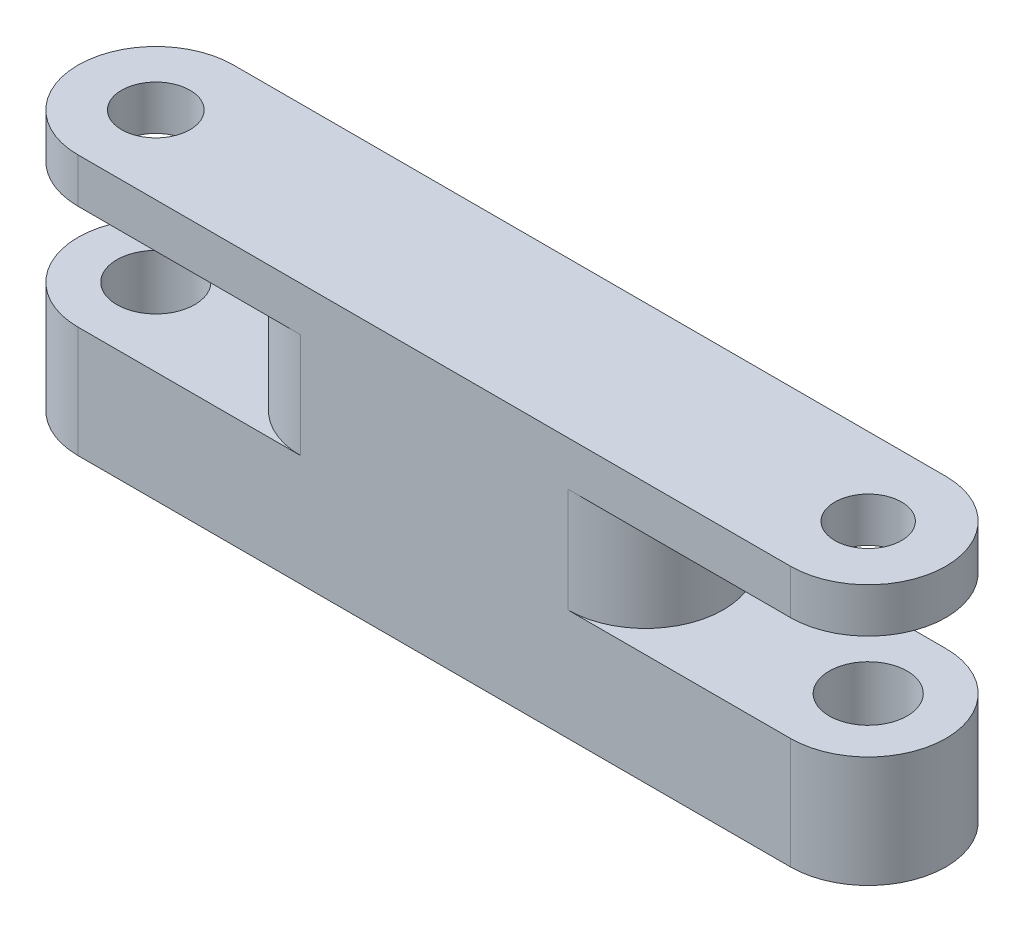
ISO-10303-21;
HEADER;
FILE_DESCRIPTION(('STEP AP214'),'2;1');
FILE_NAME('part.step','',(''),(''),'','','');
FILE_SCHEMA(('AUTOMOTIVE_DESIGN { 1 0 10303 214 1 1 1 1 }'));
ENDSEC;
DATA;
#1=APPLICATION_CONTEXT('core data for automotive mechanical design processes');
#2=APPLICATION_PROTOCOL_DEFINITION('international standard','automotive_design',2000,#1);
#3=PRODUCT_CONTEXT('',#1,'mechanical');
#4=PRODUCT('Part','Part','',(#3));
#5=PRODUCT_RELATED_PRODUCT_CATEGORY('part','',(#4));
#6=PRODUCT_DEFINITION_FORMATION('','',#4);
#7=PRODUCT_DEFINITION_CONTEXT('part definition',#1,'design');
#8=PRODUCT_DEFINITION('design','',#6,#7);
#9=PRODUCT_DEFINITION_SHAPE('','',#8);
#10=(LENGTH_UNIT() NAMED_UNIT(*) SI_UNIT(.MILLI.,.METRE.));
#11=(NAMED_UNIT(*) PLANE_ANGLE_UNIT() SI_UNIT($,.RADIAN.));
#12=(NAMED_UNIT(*) SI_UNIT($,.STERADIAN.) SOLID_ANGLE_UNIT());
#13=UNCERTAINTY_MEASURE_WITH_UNIT(LENGTH_MEASURE(1.E-05),#10,'distance_accuracy_value','');
#14=(GEOMETRIC_REPRESENTATION_CONTEXT(3) GLOBAL_UNCERTAINTY_ASSIGNED_CONTEXT((#13)) GLOBAL_UNIT_ASSIGNED_CONTEXT((#10,
#11,#12)) REPRESENTATION_CONTEXT('',''));
#15=CARTESIAN_POINT('',(0.,0.,0.));
#16=DIRECTION('',(0.,0.,1.));
#17=DIRECTION('',(1.,0.,0.));
#18=AXIS2_PLACEMENT_3D('',#15,#16,#17);
#19=CARTESIAN_POINT('',(0.,5.,0.));
#20=DIRECTION('',(0.,1.,0.));
#21=DIRECTION('',(0.,0.,1.));
#22=AXIS2_PLACEMENT_3D('',#19,#20,#21);
#23=PLANE('',#22);
#24=CARTESIAN_POINT('',(26.5685556921129,5.,-3.49360141161578));
#25=DIRECTION('',(0.,1.,0.));
#26=DIRECTION('',(0.,0.,1.));
#27=AXIS2_PLACEMENT_3D('',#24,#25,#26);
#28=CIRCLE('',#27,3.49360141161578);
#29=CARTESIAN_POINT('',(26.5685556921129,5.,0.));
#30=VERTEX_POINT('',#29);
#31=CARTESIAN_POINT('',(26.5685556921129,5.,-6.98720282323156));
#32=VERTEX_POINT('',#31);
#33=EDGE_CURVE('E232',#30,#32,#28,.T.);
#34=ORIENTED_EDGE('',*,*,#33,.F.);
#35=DIRECTION('',(1.,0.,0.));
#36=VECTOR('',#35,1.);
#37=CARTESIAN_POINT('',(0.,5.,0.));
#38=LINE('',#37,#36);
#39=CARTESIAN_POINT('',(36.5685556921129,5.,0.));
#40=VERTEX_POINT('',#39);
#41=EDGE_CURVE('E253',#30,#40,#38,.T.);
#42=ORIENTED_EDGE('',*,*,#41,.T.);
#43=CARTESIAN_POINT('',(36.5685556921129,5.,-3.49360141161578));
#44=DIRECTION('',(0.,1.,0.));
#45=DIRECTION('',(0.,0.,1.));
#46=AXIS2_PLACEMENT_3D('',#43,#44,#45);
#47=CIRCLE('',#46,3.49360141161579);
#48=CARTESIAN_POINT('',(36.5685556921129,5.,-6.98720282323157));
#49=VERTEX_POINT('',#48);
#50=EDGE_CURVE('E252',#40,#49,#47,.T.);
#51=ORIENTED_EDGE('',*,*,#50,.T.);
#52=DIRECTION('',(1.,0.,0.));
#53=VECTOR('',#52,1.);
#54=CARTESIAN_POINT('',(0.,5.,-6.98720282323156));
#55=LINE('',#54,#53);
#56=EDGE_CURVE('E92',#32,#49,#55,.T.);
#57=ORIENTED_EDGE('',*,*,#56,.F.);
#58=EDGE_LOOP('',(#34,#42,#51,#57));
#59=FACE_BOUND('',#58,.T.);
#60=CARTESIAN_POINT('',(36.5685556921129,5.,-3.49360141161578));
#61=DIRECTION('',(0.,1.,0.));
#62=DIRECTION('',(0.,0.,1.));
#63=AXIS2_PLACEMENT_3D('',#60,#61,#62);
#64=CIRCLE('',#63,1.75);
#65=CARTESIAN_POINT('',(36.5685556921129,5.,-1.74360141161578));
#66=VERTEX_POINT('',#65);
#67=EDGE_CURVE('E257',#66,#66,#64,.T.);
#68=ORIENTED_EDGE('',*,*,#67,.F.);
#69=EDGE_LOOP('',(#68));
#70=FACE_BOUND('',#69,.T.);
#71=ADVANCED_FACE('F75',(#59,#70),#23,.T.);
#72=CARTESIAN_POINT('',(36.5685556921129,5.,-3.49360141161578));
#73=DIRECTION('',(0.,-1.,0.));
#74=DIRECTION('',(0.,0.,-1.));
#75=AXIS2_PLACEMENT_3D('',#72,#73,#74);
#76=CYLINDRICAL_SURFACE('',#75,1.75);
#77=ORIENTED_EDGE('',*,*,#67,.T.);
#78=EDGE_LOOP('',(#77));
#79=FACE_BOUND('',#78,.T.);
#80=CARTESIAN_POINT('',(36.5685556921129,0.,-3.49360141161578));
#81=DIRECTION('',(0.,1.,0.));
#82=DIRECTION('',(0.,0.,1.));
#83=AXIS2_PLACEMENT_3D('',#80,#81,#82);
#84=CIRCLE('',#83,1.75);
#85=CARTESIAN_POINT('',(36.5685556921129,0.,-1.74360141161578));
#86=VERTEX_POINT('',#85);
#87=EDGE_CURVE('E271',#86,#86,#84,.T.);
#88=ORIENTED_EDGE('',*,*,#87,.F.);
#89=EDGE_LOOP('',(#88));
#90=FACE_BOUND('',#89,.T.);
#91=ADVANCED_FACE('F320',(#79,#90),#76,.F.);
#92=CARTESIAN_POINT('',(36.5685556921129,5.,-3.49360141161578));
#93=DIRECTION('',(0.,-1.,0.));
#94=DIRECTION('',(0.,0.,-1.));
#95=AXIS2_PLACEMENT_3D('',#92,#93,#94);
#96=CYLINDRICAL_SURFACE('',#95,3.49360141161579);
#97=CARTESIAN_POINT('',(36.5685556921129,0.,-3.49360141161578));
#98=DIRECTION('',(0.,1.,0.));
#99=DIRECTION('',(0.,0.,1.));
#100=AXIS2_PLACEMENT_3D('',#97,#98,#99);
#101=CIRCLE('',#100,3.49360141161579);
#102=CARTESIAN_POINT('',(36.5685556921129,0.,0.));
#103=VERTEX_POINT('',#102);
#104=CARTESIAN_POINT('',(36.5685556921129,0.,-6.98720282323157));
#105=VERTEX_POINT('',#104);
#106=EDGE_CURVE('E264',#103,#105,#101,.T.);
#107=ORIENTED_EDGE('',*,*,#106,.T.);
#108=DIRECTION('',(0.,-1.,0.));
#109=VECTOR('',#108,1.);
#110=CARTESIAN_POINT('',(36.5685556921129,5.,-6.98720282323157));
#111=LINE('',#110,#109);
#112=EDGE_CURVE('E84',#49,#105,#111,.T.);
#113=ORIENTED_EDGE('',*,*,#112,.F.);
#114=ORIENTED_EDGE('',*,*,#50,.F.);
#115=DIRECTION('',(0.,-1.,0.));
#116=VECTOR('',#115,1.);
#117=CARTESIAN_POINT('',(36.5685556921129,5.,0.));
#118=LINE('',#117,#116);
#119=EDGE_CURVE('E12',#40,#103,#118,.T.);
#120=ORIENTED_EDGE('',*,*,#119,.T.);
#121=EDGE_LOOP('',(#107,#113,#114,#120));
#122=FACE_BOUND('',#121,.T.);
#123=ADVANCED_FACE('F318',(#122),#96,.T.);
#124=CARTESIAN_POINT('',(0.,5.,-6.98720282323156));
#125=DIRECTION('',(0.,0.,-1.));
#126=DIRECTION('',(-1.,0.,0.));
#127=AXIS2_PLACEMENT_3D('',#124,#125,#126);
#128=PLANE('',#127);
#129=DIRECTION('',(1.,0.,0.));
#130=VECTOR('',#129,1.);
#131=CARTESIAN_POINT('',(0.,0.,-6.98720282323156));
#132=LINE('',#131,#130);
#133=CARTESIAN_POINT('',(4.56855569211294,0.,-6.98720282323156));
#134=VERTEX_POINT('',#133);
#135=EDGE_CURVE('E268',#134,#105,#132,.T.);
#136=ORIENTED_EDGE('',*,*,#135,.F.);
#137=DIRECTION('',(0.,-1.,0.));
#138=VECTOR('',#137,1.);
#139=CARTESIAN_POINT('',(4.56855569211294,5.,-6.98720282323156));
#140=LINE('',#139,#138);
#141=CARTESIAN_POINT('',(4.56855569211294,5.,-6.98720282323156));
#142=VERTEX_POINT('',#141);
#143=EDGE_CURVE('E275',#142,#134,#140,.T.);
#144=ORIENTED_EDGE('',*,*,#143,.F.);
#145=CARTESIAN_POINT('',(14.5685556921129,5.,-6.98720282323156));
#146=VERTEX_POINT('',#145);
#147=EDGE_CURVE('E255',#142,#146,#55,.T.);
#148=ORIENTED_EDGE('',*,*,#147,.T.);
#149=DIRECTION('',(0.,-1.,0.));
#150=VECTOR('',#149,1.);
#151=CARTESIAN_POINT('',(14.5685556921129,9.7,-6.98720282323156));
#152=LINE('',#151,#150);
#153=CARTESIAN_POINT('',(14.5685556921129,9.7,-6.98720282323156));
#154=VERTEX_POINT('',#153);
#155=EDGE_CURVE('E246',#154,#146,#152,.T.);
#156=ORIENTED_EDGE('',*,*,#155,.F.);
#157=DIRECTION('',(1.,0.,0.));
#158=VECTOR('',#157,1.);
#159=CARTESIAN_POINT('',(0.,9.7,-6.98720282323156));
#160=LINE('',#159,#158);
#161=CARTESIAN_POINT('',(4.56855569211294,9.7,-6.98720282323156));
#162=VERTEX_POINT('',#161);
#163=EDGE_CURVE('E176',#162,#154,#160,.T.);
#164=ORIENTED_EDGE('',*,*,#163,.F.);
#165=DIRECTION('',(0.,-1.,0.));
#166=VECTOR('',#165,1.);
#167=CARTESIAN_POINT('',(4.56855569211294,11.7,-6.98720282323156));
#168=LINE('',#167,#166);
#169=CARTESIAN_POINT('',(4.56855569211294,11.7,-6.98720282323156));
#170=VERTEX_POINT('',#169);
#171=EDGE_CURVE('E167',#170,#162,#168,.T.);
#172=ORIENTED_EDGE('',*,*,#171,.F.);
#173=DIRECTION('',(1.,0.,0.));
#174=VECTOR('',#173,1.);
#175=CARTESIAN_POINT('',(0.,11.7,-6.98720282323156));
#176=LINE('',#175,#174);
#177=CARTESIAN_POINT('',(36.5685556921129,11.7,-6.98720282323157));
#178=VERTEX_POINT('',#177);
#179=EDGE_CURVE('E173',#170,#178,#176,.T.);
#180=ORIENTED_EDGE('',*,*,#179,.T.);
#181=DIRECTION('',(0.,-1.,0.));
#182=VECTOR('',#181,1.);
#183=CARTESIAN_POINT('',(36.5685556921129,11.7,-6.98720282323157));
#184=LINE('',#183,#182);
#185=CARTESIAN_POINT('',(36.5685556921129,9.7,-6.98720282323157));
#186=VERTEX_POINT('',#185);
#187=EDGE_CURVE('E206',#178,#186,#184,.T.);
#188=ORIENTED_EDGE('',*,*,#187,.T.);
#189=CARTESIAN_POINT('',(26.5685556921129,9.7,-6.98720282323157));
#190=VERTEX_POINT('',#189);
#191=EDGE_CURVE('E210',#190,#186,#160,.T.);
#192=ORIENTED_EDGE('',*,*,#191,.F.);
#193=DIRECTION('',(0.,-1.,0.));
#194=VECTOR('',#193,1.);
#195=CARTESIAN_POINT('',(26.5685556921129,9.7,-6.98720282323156));
#196=LINE('',#195,#194);
#197=EDGE_CURVE('E235',#190,#32,#196,.T.);
#198=ORIENTED_EDGE('',*,*,#197,.T.);
#199=ORIENTED_EDGE('',*,*,#56,.T.);
#200=ORIENTED_EDGE('',*,*,#112,.T.);
#201=EDGE_LOOP('',(#136,#144,#148,#156,#164,#172,#180,#188,#192,#198,#199,#200));
#202=FACE_BOUND('',#201,.T.);
#203=ADVANCED_FACE('F170',(#202),#128,.T.);
#204=CARTESIAN_POINT('',(0.,5.,0.));
#205=DIRECTION('',(0.,0.,-1.));
#206=DIRECTION('',(-1.,0.,0.));
#207=AXIS2_PLACEMENT_3D('',#204,#205,#206);
#208=PLANE('',#207);
#209=DIRECTION('',(1.,0.,0.));
#210=VECTOR('',#209,1.);
#211=CARTESIAN_POINT('',(0.,0.,0.));
#212=LINE('',#211,#210);
#213=CARTESIAN_POINT('',(4.56855569211294,0.,0.));
#214=VERTEX_POINT('',#213);
#215=EDGE_CURVE('E261',#214,#103,#212,.T.);
#216=ORIENTED_EDGE('',*,*,#215,.T.);
#217=ORIENTED_EDGE('',*,*,#119,.F.);
#218=ORIENTED_EDGE('',*,*,#41,.F.);
#219=DIRECTION('',(0.,-1.,0.));
#220=VECTOR('',#219,1.);
#221=CARTESIAN_POINT('',(26.5685556921129,9.7,0.));
#222=LINE('',#221,#220);
#223=CARTESIAN_POINT('',(26.5685556921129,9.7,0.));
#224=VERTEX_POINT('',#223);
#225=EDGE_CURVE('E240',#224,#30,#222,.T.);
#226=ORIENTED_EDGE('',*,*,#225,.F.);
#227=DIRECTION('',(1.,0.,0.));
#228=VECTOR('',#227,1.);
#229=CARTESIAN_POINT('',(0.,9.7,0.));
#230=LINE('',#229,#228);
#231=CARTESIAN_POINT('',(36.5685556921129,9.7,0.));
#232=VERTEX_POINT('',#231);
#233=EDGE_CURVE('E214',#224,#232,#230,.T.);
#234=ORIENTED_EDGE('',*,*,#233,.T.);
#235=DIRECTION('',(0.,-1.,0.));
#236=VECTOR('',#235,1.);
#237=CARTESIAN_POINT('',(36.5685556921129,11.7,0.));
#238=LINE('',#237,#236);
#239=CARTESIAN_POINT('',(36.5685556921129,11.7,0.));
#240=VERTEX_POINT('',#239);
#241=EDGE_CURVE('E224',#240,#232,#238,.T.);
#242=ORIENTED_EDGE('',*,*,#241,.F.);
#243=DIRECTION('',(1.,0.,0.));
#244=VECTOR('',#243,1.);
#245=CARTESIAN_POINT('',(0.,11.7,0.));
#246=LINE('',#245,#244);
#247=CARTESIAN_POINT('',(4.56855569211294,11.7,0.));
#248=VERTEX_POINT('',#247);
#249=EDGE_CURVE('E189',#248,#240,#246,.T.);
#250=ORIENTED_EDGE('',*,*,#249,.F.);
#251=DIRECTION('',(0.,-1.,0.));
#252=VECTOR('',#251,1.);
#253=CARTESIAN_POINT('',(4.56855569211294,11.7,0.));
#254=LINE('',#253,#252);
#255=CARTESIAN_POINT('',(4.56855569211294,9.7,0.));
#256=VERTEX_POINT('',#255);
#257=EDGE_CURVE('E180',#248,#256,#254,.T.);
#258=ORIENTED_EDGE('',*,*,#257,.T.);
#259=CARTESIAN_POINT('',(14.5685556921129,9.7,0.));
#260=VERTEX_POINT('',#259);
#261=EDGE_CURVE('E215',#256,#260,#230,.T.);
#262=ORIENTED_EDGE('',*,*,#261,.T.);
#263=DIRECTION('',(0.,-1.,0.));
#264=VECTOR('',#263,1.);
#265=CARTESIAN_POINT('',(14.5685556921129,9.7,0.));
#266=LINE('',#265,#264);
#267=CARTESIAN_POINT('',(14.5685556921129,5.,0.));
#268=VERTEX_POINT('',#267);
#269=EDGE_CURVE('E243',#260,#268,#266,.T.);
#270=ORIENTED_EDGE('',*,*,#269,.T.);
#271=CARTESIAN_POINT('',(4.56855569211294,5.,0.));
#272=VERTEX_POINT('',#271);
#273=EDGE_CURVE('E250',#272,#268,#38,.T.);
#274=ORIENTED_EDGE('',*,*,#273,.F.);
#275=DIRECTION('',(0.,-1.,0.));
#276=VECTOR('',#275,1.);
#277=CARTESIAN_POINT('',(4.56855569211294,5.,0.));
#278=LINE('',#277,#276);
#279=EDGE_CURVE('E260',#272,#214,#278,.T.);
#280=ORIENTED_EDGE('',*,*,#279,.T.);
#281=EDGE_LOOP('',(#216,#217,#218,#226,#234,#242,#250,#258,#262,#270,#274,#280));
#282=FACE_BOUND('',#281,.T.);
#283=ADVANCED_FACE('F294',(#282),#208,.F.);
#284=CARTESIAN_POINT('',(0.,0.,0.));
#285=DIRECTION('',(0.,1.,0.));
#286=DIRECTION('',(0.,0.,1.));
#287=AXIS2_PLACEMENT_3D('',#284,#285,#286);
#288=PLANE('',#287);
#289=ORIENTED_EDGE('',*,*,#215,.F.);
#290=CARTESIAN_POINT('',(4.56855569211294,0.,-3.49360141161578));
#291=DIRECTION('',(0.,1.,0.));
#292=DIRECTION('',(0.,0.,1.));
#293=AXIS2_PLACEMENT_3D('',#290,#291,#292);
#294=CIRCLE('',#293,3.49360141161578);
#295=EDGE_CURVE('E79',#134,#214,#294,.T.);
#296=ORIENTED_EDGE('',*,*,#295,.F.);
#297=ORIENTED_EDGE('',*,*,#135,.T.);
#298=ORIENTED_EDGE('',*,*,#106,.F.);
#299=EDGE_LOOP('',(#289,#296,#297,#298));
#300=FACE_BOUND('',#299,.T.);
#301=ORIENTED_EDGE('',*,*,#87,.T.);
#302=EDGE_LOOP('',(#301));
#303=FACE_BOUND('',#302,.T.);
#304=CARTESIAN_POINT('',(4.56855569211294,0.,-3.49360141161578));
#305=DIRECTION('',(0.,1.,0.));
#306=DIRECTION('',(0.,0.,1.));
#307=AXIS2_PLACEMENT_3D('',#304,#305,#306);
#308=CIRCLE('',#307,1.75);
#309=CARTESIAN_POINT('',(4.56855569211294,0.,-1.74360141161578));
#310=VERTEX_POINT('',#309);
#311=EDGE_CURVE('E249',#310,#310,#308,.T.);
#312=ORIENTED_EDGE('',*,*,#311,.T.);
#313=EDGE_LOOP('',(#312));
#314=FACE_BOUND('',#313,.T.);
#315=ADVANCED_FACE('F290',(#300,#303,#314),#288,.F.);
#316=CARTESIAN_POINT('',(14.5685556921129,5.,-3.49360141161578));
#317=DIRECTION('',(0.,1.,0.));
#318=DIRECTION('',(0.,0.,1.));
#319=AXIS2_PLACEMENT_3D('',#316,#317,#318);
#320=CIRCLE('',#319,3.49360141161578);
#321=EDGE_CURVE('E100',#146,#268,#320,.T.);
#322=ORIENTED_EDGE('',*,*,#321,.F.);
#323=ORIENTED_EDGE('',*,*,#147,.F.);
#324=CARTESIAN_POINT('',(4.56855569211294,5.,-3.49360141161578));
#325=DIRECTION('',(0.,1.,0.));
#326=DIRECTION('',(0.,0.,1.));
#327=AXIS2_PLACEMENT_3D('',#324,#325,#326);
#328=CIRCLE('',#327,3.49360141161578);
#329=EDGE_CURVE('E265',#142,#272,#328,.T.);
#330=ORIENTED_EDGE('',*,*,#329,.T.);
#331=ORIENTED_EDGE('',*,*,#273,.T.);
#332=EDGE_LOOP('',(#322,#323,#330,#331));
#333=FACE_BOUND('',#332,.T.);
#334=CARTESIAN_POINT('',(4.56855569211294,5.,-3.49360141161578));
#335=DIRECTION('',(0.,1.,0.));
#336=DIRECTION('',(0.,0.,1.));
#337=AXIS2_PLACEMENT_3D('',#334,#335,#336);
#338=CIRCLE('',#337,1.75);
#339=CARTESIAN_POINT('',(4.56855569211294,5.,-1.74360141161578));
#340=VERTEX_POINT('',#339);
#341=EDGE_CURVE('E278',#340,#340,#338,.T.);
#342=ORIENTED_EDGE('',*,*,#341,.F.);
#343=EDGE_LOOP('',(#342));
#344=FACE_BOUND('',#343,.T.);
#345=ADVANCED_FACE('F296',(#333,#344),#23,.T.);
#346=CARTESIAN_POINT('',(4.56855569211294,5.,-3.49360141161578));
#347=DIRECTION('',(0.,-1.,0.));
#348=DIRECTION('',(0.,0.,-1.));
#349=AXIS2_PLACEMENT_3D('',#346,#347,#348);
#350=CYLINDRICAL_SURFACE('',#349,1.75);
#351=ORIENTED_EDGE('',*,*,#341,.T.);
#352=EDGE_LOOP('',(#351));
#353=FACE_BOUND('',#352,.T.);
#354=ORIENTED_EDGE('',*,*,#311,.F.);
#355=EDGE_LOOP('',(#354));
#356=FACE_BOUND('',#355,.T.);
#357=ADVANCED_FACE('F337',(#353,#356),#350,.F.);
#358=CARTESIAN_POINT('',(4.56855569211294,5.,-3.49360141161578));
#359=DIRECTION('',(0.,-1.,0.));
#360=DIRECTION('',(0.,0.,-1.));
#361=AXIS2_PLACEMENT_3D('',#358,#359,#360);
#362=CYLINDRICAL_SURFACE('',#361,3.49360141161578);
#363=ORIENTED_EDGE('',*,*,#295,.T.);
#364=ORIENTED_EDGE('',*,*,#279,.F.);
#365=ORIENTED_EDGE('',*,*,#329,.F.);
#366=ORIENTED_EDGE('',*,*,#143,.T.);
#367=EDGE_LOOP('',(#363,#364,#365,#366));
#368=FACE_BOUND('',#367,.T.);
#369=ADVANCED_FACE('F77',(#368),#362,.T.);
#370=CARTESIAN_POINT('',(14.5685556921129,9.7,-3.49360141161578));
#371=DIRECTION('',(0.,-1.,0.));
#372=DIRECTION('',(0.,0.,-1.));
#373=AXIS2_PLACEMENT_3D('',#370,#371,#372);
#374=CYLINDRICAL_SURFACE('',#373,3.49360141161578);
#375=ORIENTED_EDGE('',*,*,#321,.T.);
#376=ORIENTED_EDGE('',*,*,#269,.F.);
#377=CARTESIAN_POINT('',(14.5685556921129,9.7,-3.49360141161578));
#378=DIRECTION('',(0.,1.,0.));
#379=DIRECTION('',(0.,0.,1.));
#380=AXIS2_PLACEMENT_3D('',#377,#378,#379);
#381=CIRCLE('',#380,3.49360141161578);
#382=EDGE_CURVE('E228',#154,#260,#381,.T.);
#383=ORIENTED_EDGE('',*,*,#382,.F.);
#384=ORIENTED_EDGE('',*,*,#155,.T.);
#385=EDGE_LOOP('',(#375,#376,#383,#384));
#386=FACE_BOUND('',#385,.T.);
#387=ADVANCED_FACE('F299',(#386),#374,.T.);
#388=CARTESIAN_POINT('',(26.5685556921129,9.7,-3.49360141161578));
#389=DIRECTION('',(0.,-1.,0.));
#390=DIRECTION('',(0.,0.,-1.));
#391=AXIS2_PLACEMENT_3D('',#388,#389,#390);
#392=CYLINDRICAL_SURFACE('',#391,3.49360141161578);
#393=ORIENTED_EDGE('',*,*,#33,.T.);
#394=ORIENTED_EDGE('',*,*,#197,.F.);
#395=CARTESIAN_POINT('',(26.5685556921129,9.7,-3.49360141161578));
#396=DIRECTION('',(0.,1.,0.));
#397=DIRECTION('',(0.,0.,1.));
#398=AXIS2_PLACEMENT_3D('',#395,#396,#397);
#399=CIRCLE('',#398,3.49360141161578);
#400=EDGE_CURVE('E231',#224,#190,#399,.T.);
#401=ORIENTED_EDGE('',*,*,#400,.F.);
#402=ORIENTED_EDGE('',*,*,#225,.T.);
#403=EDGE_LOOP('',(#393,#394,#401,#402));
#404=FACE_BOUND('',#403,.T.);
#405=ADVANCED_FACE('F313',(#404),#392,.T.);
#406=CARTESIAN_POINT('',(0.,9.7,0.));
#407=DIRECTION('',(0.,1.,0.));
#408=DIRECTION('',(0.,0.,1.));
#409=AXIS2_PLACEMENT_3D('',#406,#407,#408);
#410=PLANE('',#409);
#411=CARTESIAN_POINT('',(4.56855569211294,9.7,-3.49360141161578));
#412=DIRECTION('',(0.,1.,0.));
#413=DIRECTION('',(0.,0.,1.));
#414=AXIS2_PLACEMENT_3D('',#411,#412,#413);
#415=CIRCLE('',#414,1.53730557060258);
#416=CARTESIAN_POINT('',(4.56855569211294,9.7,-1.95629584101321));
#417=VERTEX_POINT('',#416);
#418=EDGE_CURVE('E207',#417,#417,#415,.T.);
#419=ORIENTED_EDGE('',*,*,#418,.T.);
#420=EDGE_LOOP('',(#419));
#421=FACE_BOUND('',#420,.T.);
#422=ORIENTED_EDGE('',*,*,#163,.T.);
#423=ORIENTED_EDGE('',*,*,#382,.T.);
#424=ORIENTED_EDGE('',*,*,#261,.F.);
#425=CARTESIAN_POINT('',(4.56855569211294,9.7,-3.49360141161578));
#426=DIRECTION('',(0.,1.,0.));
#427=DIRECTION('',(0.,0.,1.));
#428=AXIS2_PLACEMENT_3D('',#425,#426,#427);
#429=CIRCLE('',#428,3.49360141161578);
#430=EDGE_CURVE('E212',#162,#256,#429,.T.);
#431=ORIENTED_EDGE('',*,*,#430,.F.);
#432=EDGE_LOOP('',(#422,#423,#424,#431));
#433=FACE_BOUND('',#432,.T.);
#434=ADVANCED_FACE('F301',(#421,#433),#410,.F.);
#435=CARTESIAN_POINT('',(4.56855569211294,11.7,-3.49360141161578));
#436=DIRECTION('',(0.,-1.,0.));
#437=DIRECTION('',(0.,0.,-1.));
#438=AXIS2_PLACEMENT_3D('',#435,#436,#437);
#439=CYLINDRICAL_SURFACE('',#438,3.49360141161578);
#440=ORIENTED_EDGE('',*,*,#430,.T.);
#441=ORIENTED_EDGE('',*,*,#257,.F.);
#442=CARTESIAN_POINT('',(4.56855569211294,11.7,-3.49360141161578));
#443=DIRECTION('',(0.,1.,0.));
#444=DIRECTION('',(0.,0.,1.));
#445=AXIS2_PLACEMENT_3D('',#442,#443,#444);
#446=CIRCLE('',#445,3.49360141161578);
#447=EDGE_CURVE('E184',#170,#248,#446,.T.);
#448=ORIENTED_EDGE('',*,*,#447,.F.);
#449=ORIENTED_EDGE('',*,*,#171,.T.);
#450=EDGE_LOOP('',(#440,#441,#448,#449));
#451=FACE_BOUND('',#450,.T.);
#452=ADVANCED_FACE('F185',(#451),#439,.T.);
#453=CARTESIAN_POINT('',(36.5685556921129,11.7,-3.49360141161578));
#454=DIRECTION('',(0.,-1.,0.));
#455=DIRECTION('',(0.,0.,-1.));
#456=AXIS2_PLACEMENT_3D('',#453,#454,#455);
#457=CYLINDRICAL_SURFACE('',#456,3.49360141161579);
#458=CARTESIAN_POINT('',(36.5685556921129,9.7,-3.49360141161578));
#459=DIRECTION('',(0.,1.,0.));
#460=DIRECTION('',(0.,0.,1.));
#461=AXIS2_PLACEMENT_3D('',#458,#459,#460);
#462=CIRCLE('',#461,3.49360141161579);
#463=EDGE_CURVE('E218',#232,#186,#462,.T.);
#464=ORIENTED_EDGE('',*,*,#463,.T.);
#465=ORIENTED_EDGE('',*,*,#187,.F.);
#466=CARTESIAN_POINT('',(36.5685556921129,11.7,-3.49360141161578));
#467=DIRECTION('',(0.,1.,0.));
#468=DIRECTION('',(0.,0.,1.));
#469=AXIS2_PLACEMENT_3D('',#466,#467,#468);
#470=CIRCLE('',#469,3.49360141161579);
#471=EDGE_CURVE('E193',#240,#178,#470,.T.);
#472=ORIENTED_EDGE('',*,*,#471,.F.);
#473=ORIENTED_EDGE('',*,*,#241,.T.);
#474=EDGE_LOOP('',(#464,#465,#472,#473));
#475=FACE_BOUND('',#474,.T.);
#476=ADVANCED_FACE('F306',(#475),#457,.T.);
#477=CARTESIAN_POINT('',(4.56855569211294,11.7,-3.49360141161578));
#478=DIRECTION('',(0.,-1.,0.));
#479=DIRECTION('',(0.,0.,-1.));
#480=AXIS2_PLACEMENT_3D('',#477,#478,#479);
#481=CYLINDRICAL_SURFACE('',#480,1.53730557060258);
#482=CARTESIAN_POINT('',(4.56855569211294,11.7,-3.49360141161578));
#483=DIRECTION('',(0.,1.,0.));
#484=DIRECTION('',(0.,0.,1.));
#485=AXIS2_PLACEMENT_3D('',#482,#483,#484);
#486=CIRCLE('',#485,1.53730557060258);
#487=CARTESIAN_POINT('',(4.56855569211294,11.7,-1.95629584101321));
#488=VERTEX_POINT('',#487);
#489=EDGE_CURVE('E195',#488,#488,#486,.T.);
#490=ORIENTED_EDGE('',*,*,#489,.T.);
#491=EDGE_LOOP('',(#490));
#492=FACE_BOUND('',#491,.T.);
#493=ORIENTED_EDGE('',*,*,#418,.F.);
#494=EDGE_LOOP('',(#493));
#495=FACE_BOUND('',#494,.T.);
#496=ADVANCED_FACE('F352',(#492,#495),#481,.F.);
#497=CARTESIAN_POINT('',(36.5685556921129,11.7,-3.49360141161578));
#498=DIRECTION('',(0.,-1.,0.));
#499=DIRECTION('',(0.,0.,-1.));
#500=AXIS2_PLACEMENT_3D('',#497,#498,#499);
#501=CYLINDRICAL_SURFACE('',#500,1.5);
#502=CARTESIAN_POINT('',(36.5685556921129,11.7,-3.49360141161578));
#503=DIRECTION('',(0.,1.,0.));
#504=DIRECTION('',(0.,0.,1.));
#505=AXIS2_PLACEMENT_3D('',#502,#503,#504);
#506=CIRCLE('',#505,1.5);
#507=CARTESIAN_POINT('',(36.5685556921129,11.7,-1.99360141161578));
#508=VERTEX_POINT('',#507);
#509=EDGE_CURVE('E203',#508,#508,#506,.T.);
#510=ORIENTED_EDGE('',*,*,#509,.T.);
#511=EDGE_LOOP('',(#510));
#512=FACE_BOUND('',#511,.T.);
#513=CARTESIAN_POINT('',(36.5685556921129,9.7,-3.49360141161578));
#514=DIRECTION('',(0.,1.,0.));
#515=DIRECTION('',(0.,0.,1.));
#516=AXIS2_PLACEMENT_3D('',#513,#514,#515);
#517=CIRCLE('',#516,1.5);
#518=CARTESIAN_POINT('',(36.5685556921129,9.7,-1.99360141161578));
#519=VERTEX_POINT('',#518);
#520=EDGE_CURVE('E198',#519,#519,#517,.T.);
#521=ORIENTED_EDGE('',*,*,#520,.F.);
#522=EDGE_LOOP('',(#521));
#523=FACE_BOUND('',#522,.T.);
#524=ADVANCED_FACE('F355',(#512,#523),#501,.F.);
#525=CARTESIAN_POINT('',(0.,11.7,0.));
#526=DIRECTION('',(0.,1.,0.));
#527=DIRECTION('',(0.,0.,1.));
#528=AXIS2_PLACEMENT_3D('',#525,#526,#527);
#529=PLANE('',#528);
#530=ORIENTED_EDGE('',*,*,#489,.F.);
#531=EDGE_LOOP('',(#530));
#532=FACE_BOUND('',#531,.T.);
#533=ORIENTED_EDGE('',*,*,#179,.F.);
#534=ORIENTED_EDGE('',*,*,#447,.T.);
#535=ORIENTED_EDGE('',*,*,#249,.T.);
#536=ORIENTED_EDGE('',*,*,#471,.T.);
#537=EDGE_LOOP('',(#533,#534,#535,#536));
#538=FACE_BOUND('',#537,.T.);
#539=ORIENTED_EDGE('',*,*,#509,.F.);
#540=EDGE_LOOP('',(#539));
#541=FACE_BOUND('',#540,.T.);
#542=ADVANCED_FACE('F191',(#532,#538,#541),#529,.T.);
#543=ORIENTED_EDGE('',*,*,#233,.F.);
#544=ORIENTED_EDGE('',*,*,#400,.T.);
#545=ORIENTED_EDGE('',*,*,#191,.T.);
#546=ORIENTED_EDGE('',*,*,#463,.F.);
#547=EDGE_LOOP('',(#543,#544,#545,#546));
#548=FACE_BOUND('',#547,.T.);
#549=ORIENTED_EDGE('',*,*,#520,.T.);
#550=EDGE_LOOP('',(#549));
#551=FACE_BOUND('',#550,.T.);
#552=ADVANCED_FACE('F309',(#548,#551),#410,.F.);
#553=CLOSED_SHELL('',(#71,#91,#123,#203,#283,#315,#345,#357,#369,#387,#405,#434,#452,#476,#496,
#524,#542,#552));
#554=MANIFOLD_SOLID_BREP('B2',#553);
#555=ADVANCED_BREP_SHAPE_REPRESENTATION('',(#18,#554),#14);
#556=SHAPE_DEFINITION_REPRESENTATION(#9,#555);
ENDSEC;
END-ISO-10303-21;
